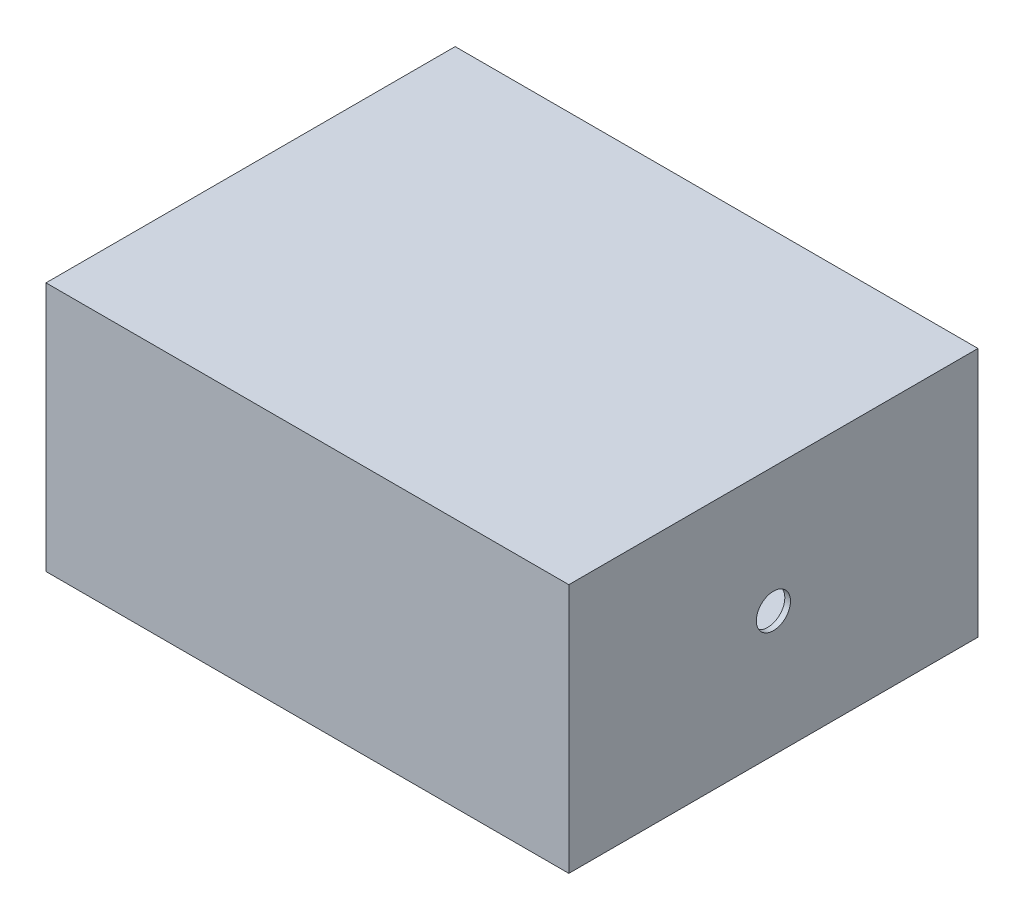
ISO-10303-21;
HEADER;
FILE_DESCRIPTION(('STEP AP214'),'2;1');
FILE_NAME('part.step','',(''),(''),'','','');
FILE_SCHEMA(('AUTOMOTIVE_DESIGN { 1 0 10303 214 1 1 1 1 }'));
ENDSEC;
DATA;
#1=APPLICATION_CONTEXT('core data for automotive mechanical design processes');
#2=APPLICATION_PROTOCOL_DEFINITION('international standard','automotive_design',2000,#1);
#3=PRODUCT_CONTEXT('',#1,'mechanical');
#4=PRODUCT('Part','Part','',(#3));
#5=PRODUCT_RELATED_PRODUCT_CATEGORY('part','',(#4));
#6=PRODUCT_DEFINITION_FORMATION('','',#4);
#7=PRODUCT_DEFINITION_CONTEXT('part definition',#1,'design');
#8=PRODUCT_DEFINITION('design','',#6,#7);
#9=PRODUCT_DEFINITION_SHAPE('','',#8);
#10=(LENGTH_UNIT() NAMED_UNIT(*) SI_UNIT(.MILLI.,.METRE.));
#11=(NAMED_UNIT(*) PLANE_ANGLE_UNIT() SI_UNIT($,.RADIAN.));
#12=(NAMED_UNIT(*) SI_UNIT($,.STERADIAN.) SOLID_ANGLE_UNIT());
#13=UNCERTAINTY_MEASURE_WITH_UNIT(LENGTH_MEASURE(1.E-05),#10,'distance_accuracy_value','');
#14=(GEOMETRIC_REPRESENTATION_CONTEXT(3) GLOBAL_UNCERTAINTY_ASSIGNED_CONTEXT((#13)) GLOBAL_UNIT_ASSIGNED_CONTEXT((#10,
#11,#12)) REPRESENTATION_CONTEXT('',''));
#15=CARTESIAN_POINT('',(0.,0.,0.));
#16=DIRECTION('',(0.,0.,1.));
#17=DIRECTION('',(1.,0.,0.));
#18=AXIS2_PLACEMENT_3D('',#15,#16,#17);
#19=CARTESIAN_POINT('',(460.,440.,-360.));
#20=DIRECTION('',(-1.,0.,0.));
#21=DIRECTION('',(0.,0.,1.));
#22=AXIS2_PLACEMENT_3D('',#19,#20,#21);
#23=PLANE('',#22);
#24=CARTESIAN_POINT('',(460.,220.,-1.16805870985997E-13));
#25=DIRECTION('',(1.,0.,0.));
#26=DIRECTION('',(0.,0.,-1.));
#27=AXIS2_PLACEMENT_3D('',#24,#25,#26);
#28=CIRCLE('',#27,30.0753323424348);
#29=CARTESIAN_POINT('',(460.,220.,-30.0753323424349));
#30=VERTEX_POINT('',#29);
#31=EDGE_CURVE('E143',#30,#30,#28,.T.);
#32=ORIENTED_EDGE('',*,*,#31,.F.);
#33=EDGE_LOOP('',(#32));
#34=FACE_BOUND('',#33,.T.);
#35=DIRECTION('',(0.,0.,-1.));
#36=VECTOR('',#35,1.);
#37=CARTESIAN_POINT('',(460.,0.,-360.));
#38=LINE('',#37,#36);
#39=CARTESIAN_POINT('',(460.,0.,360.));
#40=VERTEX_POINT('',#39);
#41=CARTESIAN_POINT('',(460.,0.,-360.));
#42=VERTEX_POINT('',#41);
#43=EDGE_CURVE('E140',#40,#42,#38,.T.);
#44=ORIENTED_EDGE('',*,*,#43,.T.);
#45=DIRECTION('',(0.,-1.,0.));
#46=VECTOR('',#45,1.);
#47=CARTESIAN_POINT('',(460.,440.,-360.));
#48=LINE('',#47,#46);
#49=CARTESIAN_POINT('',(460.,440.,-360.));
#50=VERTEX_POINT('',#49);
#51=EDGE_CURVE('E131',#50,#42,#48,.T.);
#52=ORIENTED_EDGE('',*,*,#51,.F.);
#53=DIRECTION('',(0.,0.,-1.));
#54=VECTOR('',#53,1.);
#55=CARTESIAN_POINT('',(460.,440.,-360.));
#56=LINE('',#55,#54);
#57=CARTESIAN_POINT('',(460.,440.,360.));
#58=VERTEX_POINT('',#57);
#59=EDGE_CURVE('E125',#58,#50,#56,.T.);
#60=ORIENTED_EDGE('',*,*,#59,.F.);
#61=DIRECTION('',(0.,-1.,0.));
#62=VECTOR('',#61,1.);
#63=CARTESIAN_POINT('',(460.,440.,360.));
#64=LINE('',#63,#62);
#65=EDGE_CURVE('E136',#58,#40,#64,.T.);
#66=ORIENTED_EDGE('',*,*,#65,.T.);
#67=EDGE_LOOP('',(#44,#52,#60,#66));
#68=FACE_BOUND('',#67,.T.);
#69=ADVANCED_FACE('F35',(#34,#68),#23,.F.);
#70=CARTESIAN_POINT('',(-460.,440.,-360.));
#71=DIRECTION('',(0.,0.,1.));
#72=DIRECTION('',(1.,0.,0.));
#73=AXIS2_PLACEMENT_3D('',#70,#71,#72);
#74=PLANE('',#73);
#75=DIRECTION('',(-1.,0.,0.));
#76=VECTOR('',#75,1.);
#77=CARTESIAN_POINT('',(-460.,0.,-360.));
#78=LINE('',#77,#76);
#79=CARTESIAN_POINT('',(-460.,0.,-360.));
#80=VERTEX_POINT('',#79);
#81=EDGE_CURVE('E130',#42,#80,#78,.T.);
#82=ORIENTED_EDGE('',*,*,#81,.T.);
#83=DIRECTION('',(0.,-1.,0.));
#84=VECTOR('',#83,1.);
#85=CARTESIAN_POINT('',(-460.,440.,-360.));
#86=LINE('',#85,#84);
#87=CARTESIAN_POINT('',(-460.,440.,-360.));
#88=VERTEX_POINT('',#87);
#89=EDGE_CURVE('E128',#88,#80,#86,.T.);
#90=ORIENTED_EDGE('',*,*,#89,.F.);
#91=DIRECTION('',(-1.,0.,0.));
#92=VECTOR('',#91,1.);
#93=CARTESIAN_POINT('',(-460.,440.,-360.));
#94=LINE('',#93,#92);
#95=EDGE_CURVE('E120',#50,#88,#94,.T.);
#96=ORIENTED_EDGE('',*,*,#95,.F.);
#97=ORIENTED_EDGE('',*,*,#51,.T.);
#98=EDGE_LOOP('',(#82,#90,#96,#97));
#99=FACE_BOUND('',#98,.T.);
#100=ADVANCED_FACE('F129',(#99),#74,.F.);
#101=CARTESIAN_POINT('',(-460.,440.,-360.));
#102=DIRECTION('',(1.,0.,0.));
#103=DIRECTION('',(0.,0.,-1.));
#104=AXIS2_PLACEMENT_3D('',#101,#102,#103);
#105=PLANE('',#104);
#106=DIRECTION('',(0.,0.,1.));
#107=VECTOR('',#106,1.);
#108=CARTESIAN_POINT('',(-460.,0.,-360.));
#109=LINE('',#108,#107);
#110=CARTESIAN_POINT('',(-460.,0.,360.));
#111=VERTEX_POINT('',#110);
#112=EDGE_CURVE('E106',#80,#111,#109,.T.);
#113=ORIENTED_EDGE('',*,*,#112,.T.);
#114=DIRECTION('',(0.,-1.,0.));
#115=VECTOR('',#114,1.);
#116=CARTESIAN_POINT('',(-460.,440.,360.));
#117=LINE('',#116,#115);
#118=CARTESIAN_POINT('',(-460.,440.,360.));
#119=VERTEX_POINT('',#118);
#120=EDGE_CURVE('E132',#119,#111,#117,.T.);
#121=ORIENTED_EDGE('',*,*,#120,.F.);
#122=DIRECTION('',(0.,0.,1.));
#123=VECTOR('',#122,1.);
#124=CARTESIAN_POINT('',(-460.,440.,-360.));
#125=LINE('',#124,#123);
#126=EDGE_CURVE('E123',#88,#119,#125,.T.);
#127=ORIENTED_EDGE('',*,*,#126,.F.);
#128=ORIENTED_EDGE('',*,*,#89,.T.);
#129=EDGE_LOOP('',(#113,#121,#127,#128));
#130=FACE_BOUND('',#129,.T.);
#131=ADVANCED_FACE('F134',(#130),#105,.F.);
#132=CARTESIAN_POINT('',(-460.,440.,360.));
#133=DIRECTION('',(0.,0.,-1.));
#134=DIRECTION('',(-1.,0.,0.));
#135=AXIS2_PLACEMENT_3D('',#132,#133,#134);
#136=PLANE('',#135);
#137=DIRECTION('',(1.,0.,0.));
#138=VECTOR('',#137,1.);
#139=CARTESIAN_POINT('',(-460.,0.,360.));
#140=LINE('',#139,#138);
#141=EDGE_CURVE('E112',#111,#40,#140,.T.);
#142=ORIENTED_EDGE('',*,*,#141,.T.);
#143=ORIENTED_EDGE('',*,*,#65,.F.);
#144=DIRECTION('',(1.,0.,0.));
#145=VECTOR('',#144,1.);
#146=CARTESIAN_POINT('',(-460.,440.,360.));
#147=LINE('',#146,#145);
#148=EDGE_CURVE('E89',#119,#58,#147,.T.);
#149=ORIENTED_EDGE('',*,*,#148,.F.);
#150=ORIENTED_EDGE('',*,*,#120,.T.);
#151=EDGE_LOOP('',(#142,#143,#149,#150));
#152=FACE_BOUND('',#151,.T.);
#153=ADVANCED_FACE('F283',(#152),#136,.F.);
#154=CARTESIAN_POINT('',(0.,440.,0.));
#155=DIRECTION('',(0.,1.,0.));
#156=DIRECTION('',(0.,0.,1.));
#157=AXIS2_PLACEMENT_3D('',#154,#155,#156);
#158=PLANE('',#157);
#159=ORIENTED_EDGE('',*,*,#59,.T.);
#160=ORIENTED_EDGE('',*,*,#95,.T.);
#161=ORIENTED_EDGE('',*,*,#126,.T.);
#162=ORIENTED_EDGE('',*,*,#148,.T.);
#163=EDGE_LOOP('',(#159,#160,#161,#162));
#164=FACE_BOUND('',#163,.T.);
#165=ADVANCED_FACE('F121',(#164),#158,.T.);
#166=CARTESIAN_POINT('',(0.,0.,0.));
#167=DIRECTION('',(0.,1.,0.));
#168=DIRECTION('',(0.,0.,1.));
#169=AXIS2_PLACEMENT_3D('',#166,#167,#168);
#170=PLANE('',#169);
#171=ORIENTED_EDGE('',*,*,#43,.F.);
#172=ORIENTED_EDGE('',*,*,#141,.F.);
#173=ORIENTED_EDGE('',*,*,#112,.F.);
#174=ORIENTED_EDGE('',*,*,#81,.F.);
#175=EDGE_LOOP('',(#171,#172,#173,#174));
#176=FACE_BOUND('',#175,.T.);
#177=ADVANCED_FACE('F232',(#176),#170,.F.);
#178=CARTESIAN_POINT('',(-460.001,220.,-1.16805870985997E-13));
#179=DIRECTION('',(1.,0.,0.));
#180=DIRECTION('',(0.,0.,-1.));
#181=AXIS2_PLACEMENT_3D('',#178,#179,#180);
#182=CYLINDRICAL_SURFACE('',#181,30.0753323424348);
#183=CARTESIAN_POINT('',(450.,220.,-1.16805870985997E-13));
#184=DIRECTION('',(-1.,0.,0.));
#185=DIRECTION('',(0.,0.,1.));
#186=AXIS2_PLACEMENT_3D('',#183,#184,#185);
#187=CIRCLE('',#186,30.0753323424348);
#188=CARTESIAN_POINT('',(450.,220.,30.0753323424346));
#189=VERTEX_POINT('',#188);
#190=EDGE_CURVE('E319',#189,#189,#187,.F.);
#191=ORIENTED_EDGE('',*,*,#190,.F.);
#192=EDGE_LOOP('',(#191));
#193=FACE_BOUND('',#192,.T.);
#194=ORIENTED_EDGE('',*,*,#31,.T.);
#195=EDGE_LOOP('',(#194));
#196=FACE_BOUND('',#195,.T.);
#197=ADVANCED_FACE('F202',(#193,#196),#182,.F.);
#198=CARTESIAN_POINT('',(450.,440.,-360.));
#199=DIRECTION('',(-1.,0.,0.));
#200=DIRECTION('',(0.,0.,1.));
#201=AXIS2_PLACEMENT_3D('',#198,#199,#200);
#202=PLANE('',#201);
#203=ORIENTED_EDGE('',*,*,#190,.T.);
#204=EDGE_LOOP('',(#203));
#205=FACE_BOUND('',#204,.T.);
#206=DIRECTION('',(0.,0.,-1.));
#207=VECTOR('',#206,1.);
#208=CARTESIAN_POINT('',(450.,10.,-360.));
#209=LINE('',#208,#207);
#210=CARTESIAN_POINT('',(450.,10.,350.));
#211=VERTEX_POINT('',#210);
#212=CARTESIAN_POINT('',(450.,10.,-350.));
#213=VERTEX_POINT('',#212);
#214=EDGE_CURVE('E39',#211,#213,#209,.T.);
#215=ORIENTED_EDGE('',*,*,#214,.F.);
#216=DIRECTION('',(0.,-1.,0.));
#217=VECTOR('',#216,1.);
#218=CARTESIAN_POINT('',(450.,440.,350.));
#219=LINE('',#218,#217);
#220=CARTESIAN_POINT('',(450.,430.,350.));
#221=VERTEX_POINT('',#220);
#222=EDGE_CURVE('E165',#221,#211,#219,.T.);
#223=ORIENTED_EDGE('',*,*,#222,.F.);
#224=DIRECTION('',(0.,0.,-1.));
#225=VECTOR('',#224,1.);
#226=CARTESIAN_POINT('',(450.,430.,-360.));
#227=LINE('',#226,#225);
#228=CARTESIAN_POINT('',(450.,430.,-350.));
#229=VERTEX_POINT('',#228);
#230=EDGE_CURVE('E152',#221,#229,#227,.T.);
#231=ORIENTED_EDGE('',*,*,#230,.T.);
#232=DIRECTION('',(0.,-1.,0.));
#233=VECTOR('',#232,1.);
#234=CARTESIAN_POINT('',(450.,440.,-350.));
#235=LINE('',#234,#233);
#236=EDGE_CURVE('E163',#229,#213,#235,.T.);
#237=ORIENTED_EDGE('',*,*,#236,.T.);
#238=EDGE_LOOP('',(#215,#223,#231,#237));
#239=FACE_BOUND('',#238,.T.);
#240=ADVANCED_FACE('F172',(#205,#239),#202,.T.);
#241=CARTESIAN_POINT('',(-460.,440.,-350.));
#242=DIRECTION('',(0.,0.,1.));
#243=DIRECTION('',(1.,0.,0.));
#244=AXIS2_PLACEMENT_3D('',#241,#242,#243);
#245=PLANE('',#244);
#246=DIRECTION('',(-1.,0.,0.));
#247=VECTOR('',#246,1.);
#248=CARTESIAN_POINT('',(-460.,10.,-350.));
#249=LINE('',#248,#247);
#250=CARTESIAN_POINT('',(-450.,10.,-350.));
#251=VERTEX_POINT('',#250);
#252=EDGE_CURVE('E54',#213,#251,#249,.T.);
#253=ORIENTED_EDGE('',*,*,#252,.F.);
#254=ORIENTED_EDGE('',*,*,#236,.F.);
#255=DIRECTION('',(-1.,0.,0.));
#256=VECTOR('',#255,1.);
#257=CARTESIAN_POINT('',(-460.,430.,-350.));
#258=LINE('',#257,#256);
#259=CARTESIAN_POINT('',(-450.,430.,-350.));
#260=VERTEX_POINT('',#259);
#261=EDGE_CURVE('E77',#229,#260,#258,.T.);
#262=ORIENTED_EDGE('',*,*,#261,.T.);
#263=DIRECTION('',(0.,-1.,0.));
#264=VECTOR('',#263,1.);
#265=CARTESIAN_POINT('',(-450.,440.,-350.));
#266=LINE('',#265,#264);
#267=EDGE_CURVE('E159',#260,#251,#266,.T.);
#268=ORIENTED_EDGE('',*,*,#267,.T.);
#269=EDGE_LOOP('',(#253,#254,#262,#268));
#270=FACE_BOUND('',#269,.T.);
#271=ADVANCED_FACE('F173',(#270),#245,.T.);
#272=CARTESIAN_POINT('',(-450.,440.,-360.));
#273=DIRECTION('',(1.,0.,0.));
#274=DIRECTION('',(0.,0.,-1.));
#275=AXIS2_PLACEMENT_3D('',#272,#273,#274);
#276=PLANE('',#275);
#277=DIRECTION('',(0.,0.,1.));
#278=VECTOR('',#277,1.);
#279=CARTESIAN_POINT('',(-450.,10.,-360.));
#280=LINE('',#279,#278);
#281=CARTESIAN_POINT('',(-450.,10.,350.));
#282=VERTEX_POINT('',#281);
#283=EDGE_CURVE('E161',#251,#282,#280,.T.);
#284=ORIENTED_EDGE('',*,*,#283,.F.);
#285=ORIENTED_EDGE('',*,*,#267,.F.);
#286=DIRECTION('',(0.,0.,1.));
#287=VECTOR('',#286,1.);
#288=CARTESIAN_POINT('',(-450.,430.,-360.));
#289=LINE('',#288,#287);
#290=CARTESIAN_POINT('',(-450.,430.,350.));
#291=VERTEX_POINT('',#290);
#292=EDGE_CURVE('E45',#260,#291,#289,.T.);
#293=ORIENTED_EDGE('',*,*,#292,.T.);
#294=DIRECTION('',(0.,-1.,0.));
#295=VECTOR('',#294,1.);
#296=CARTESIAN_POINT('',(-450.,440.,350.));
#297=LINE('',#296,#295);
#298=EDGE_CURVE('E154',#291,#282,#297,.T.);
#299=ORIENTED_EDGE('',*,*,#298,.T.);
#300=EDGE_LOOP('',(#284,#285,#293,#299));
#301=FACE_BOUND('',#300,.T.);
#302=ADVANCED_FACE('F177',(#301),#276,.T.);
#303=CARTESIAN_POINT('',(-460.,440.,350.));
#304=DIRECTION('',(0.,0.,-1.));
#305=DIRECTION('',(-1.,0.,0.));
#306=AXIS2_PLACEMENT_3D('',#303,#304,#305);
#307=PLANE('',#306);
#308=DIRECTION('',(1.,0.,0.));
#309=VECTOR('',#308,1.);
#310=CARTESIAN_POINT('',(-460.,10.,350.));
#311=LINE('',#310,#309);
#312=EDGE_CURVE('E157',#282,#211,#311,.T.);
#313=ORIENTED_EDGE('',*,*,#312,.F.);
#314=ORIENTED_EDGE('',*,*,#298,.F.);
#315=DIRECTION('',(1.,0.,0.));
#316=VECTOR('',#315,1.);
#317=CARTESIAN_POINT('',(-460.,430.,350.));
#318=LINE('',#317,#316);
#319=EDGE_CURVE('E11',#291,#221,#318,.T.);
#320=ORIENTED_EDGE('',*,*,#319,.T.);
#321=ORIENTED_EDGE('',*,*,#222,.T.);
#322=EDGE_LOOP('',(#313,#314,#320,#321));
#323=FACE_BOUND('',#322,.T.);
#324=ADVANCED_FACE('F181',(#323),#307,.T.);
#325=CARTESIAN_POINT('',(0.,430.,0.));
#326=DIRECTION('',(0.,1.,0.));
#327=DIRECTION('',(0.,0.,1.));
#328=AXIS2_PLACEMENT_3D('',#325,#326,#327);
#329=PLANE('',#328);
#330=ORIENTED_EDGE('',*,*,#230,.F.);
#331=ORIENTED_EDGE('',*,*,#319,.F.);
#332=ORIENTED_EDGE('',*,*,#292,.F.);
#333=ORIENTED_EDGE('',*,*,#261,.F.);
#334=EDGE_LOOP('',(#330,#331,#332,#333));
#335=FACE_BOUND('',#334,.T.);
#336=ADVANCED_FACE('F180',(#335),#329,.F.);
#337=CARTESIAN_POINT('',(0.,10.,0.));
#338=DIRECTION('',(0.,1.,0.));
#339=DIRECTION('',(0.,0.,1.));
#340=AXIS2_PLACEMENT_3D('',#337,#338,#339);
#341=PLANE('',#340);
#342=ORIENTED_EDGE('',*,*,#214,.T.);
#343=ORIENTED_EDGE('',*,*,#252,.T.);
#344=ORIENTED_EDGE('',*,*,#283,.T.);
#345=ORIENTED_EDGE('',*,*,#312,.T.);
#346=EDGE_LOOP('',(#342,#343,#344,#345));
#347=FACE_BOUND('',#346,.T.);
#348=ADVANCED_FACE('F37',(#347),#341,.T.);
#349=CLOSED_SHELL('',(#69,#100,#131,#153,#165,#177,#197,#240,#271,#302,#324,#336,#348));
#350=MANIFOLD_SOLID_BREP('B2',#349);
#351=ADVANCED_BREP_SHAPE_REPRESENTATION('',(#18,#350),#14);
#352=SHAPE_DEFINITION_REPRESENTATION(#9,#351);
ENDSEC;
END-ISO-10303-21;
